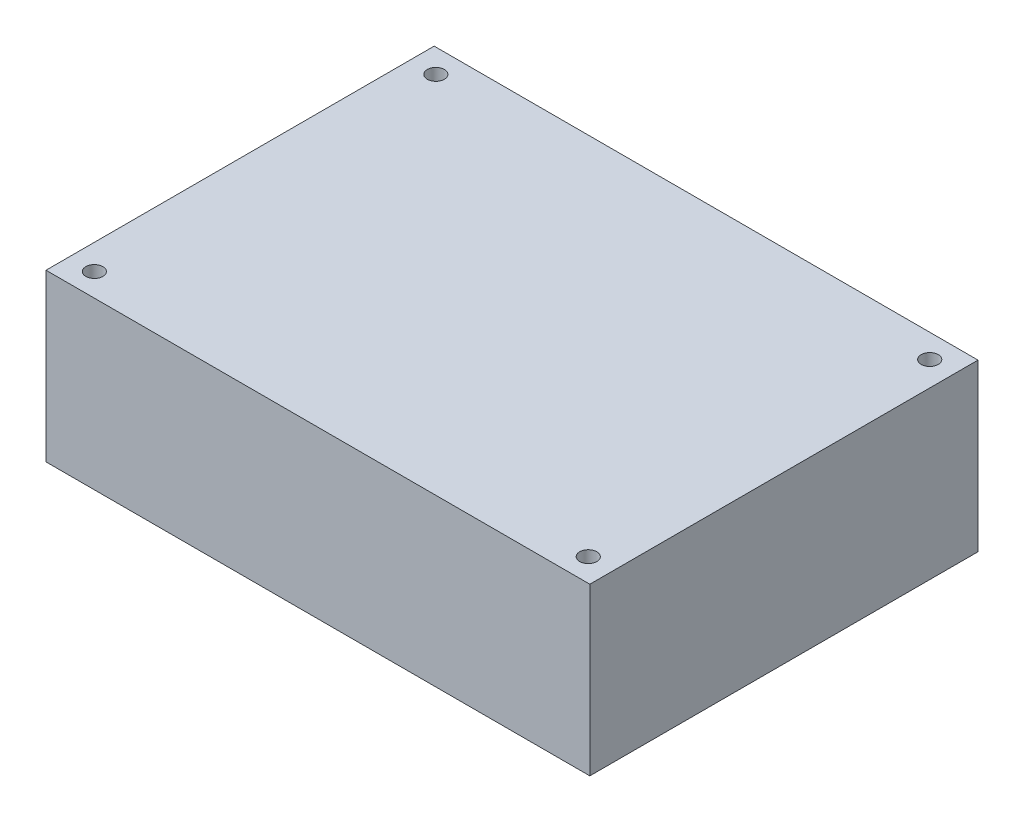
ISO-10303-21;
HEADER;
FILE_DESCRIPTION(('STEP AP214'),'2;1');
FILE_NAME('part.step','',(''),(''),'','','');
FILE_SCHEMA(('AUTOMOTIVE_DESIGN { 1 0 10303 214 1 1 1 1 }'));
ENDSEC;
DATA;
#1=APPLICATION_CONTEXT('core data for automotive mechanical design processes');
#2=APPLICATION_PROTOCOL_DEFINITION('international standard','automotive_design',2000,#1);
#3=PRODUCT_CONTEXT('',#1,'mechanical');
#4=PRODUCT('Part','Part','',(#3));
#5=PRODUCT_RELATED_PRODUCT_CATEGORY('part','',(#4));
#6=PRODUCT_DEFINITION_FORMATION('','',#4);
#7=PRODUCT_DEFINITION_CONTEXT('part definition',#1,'design');
#8=PRODUCT_DEFINITION('design','',#6,#7);
#9=PRODUCT_DEFINITION_SHAPE('','',#8);
#10=(LENGTH_UNIT() NAMED_UNIT(*) SI_UNIT(.MILLI.,.METRE.));
#11=(NAMED_UNIT(*) PLANE_ANGLE_UNIT() SI_UNIT($,.RADIAN.));
#12=(NAMED_UNIT(*) SI_UNIT($,.STERADIAN.) SOLID_ANGLE_UNIT());
#13=UNCERTAINTY_MEASURE_WITH_UNIT(LENGTH_MEASURE(1.E-05),#10,'distance_accuracy_value','');
#14=(GEOMETRIC_REPRESENTATION_CONTEXT(3) GLOBAL_UNCERTAINTY_ASSIGNED_CONTEXT((#13)) GLOBAL_UNIT_ASSIGNED_CONTEXT((#10,
#11,#12)) REPRESENTATION_CONTEXT('',''));
#15=CARTESIAN_POINT('',(0.,0.,0.));
#16=DIRECTION('',(0.,0.,1.));
#17=DIRECTION('',(1.,0.,0.));
#18=AXIS2_PLACEMENT_3D('',#15,#16,#17);
#19=CARTESIAN_POINT('',(-35.052,21.3995,-25.019));
#20=DIRECTION('',(1.,0.,0.));
#21=DIRECTION('',(0.,0.,-1.));
#22=AXIS2_PLACEMENT_3D('',#19,#20,#21);
#23=PLANE('',#22);
#24=DIRECTION('',(0.,0.,1.));
#25=VECTOR('',#24,1.);
#26=CARTESIAN_POINT('',(-35.052,0.,-25.019));
#27=LINE('',#26,#25);
#28=CARTESIAN_POINT('',(-35.052,0.,-25.019));
#29=VERTEX_POINT('',#28);
#30=CARTESIAN_POINT('',(-35.052,0.,25.019));
#31=VERTEX_POINT('',#30);
#32=EDGE_CURVE('E123',#29,#31,#27,.T.);
#33=ORIENTED_EDGE('',*,*,#32,.T.);
#34=DIRECTION('',(0.,-1.,0.));
#35=VECTOR('',#34,1.);
#36=CARTESIAN_POINT('',(-35.052,21.3995,25.019));
#37=LINE('',#36,#35);
#38=CARTESIAN_POINT('',(-35.052,21.3995,25.019));
#39=VERTEX_POINT('',#38);
#40=EDGE_CURVE('E13',#39,#31,#37,.T.);
#41=ORIENTED_EDGE('',*,*,#40,.F.);
#42=DIRECTION('',(0.,0.,1.));
#43=VECTOR('',#42,1.);
#44=CARTESIAN_POINT('',(-35.052,21.3995,-25.019));
#45=LINE('',#44,#43);
#46=CARTESIAN_POINT('',(-35.052,21.3995,-25.019));
#47=VERTEX_POINT('',#46);
#48=EDGE_CURVE('E107',#47,#39,#45,.T.);
#49=ORIENTED_EDGE('',*,*,#48,.F.);
#50=DIRECTION('',(0.,-1.,0.));
#51=VECTOR('',#50,1.);
#52=CARTESIAN_POINT('',(-35.052,21.3995,-25.019));
#53=LINE('',#52,#51);
#54=EDGE_CURVE('E119',#47,#29,#53,.T.);
#55=ORIENTED_EDGE('',*,*,#54,.T.);
#56=EDGE_LOOP('',(#33,#41,#49,#55));
#57=FACE_BOUND('',#56,.T.);
#58=ADVANCED_FACE('F55',(#57),#23,.F.);
#59=CARTESIAN_POINT('',(-35.052,21.3995,25.019));
#60=DIRECTION('',(0.,0.,-1.));
#61=DIRECTION('',(-1.,0.,0.));
#62=AXIS2_PLACEMENT_3D('',#59,#60,#61);
#63=PLANE('',#62);
#64=DIRECTION('',(1.,0.,0.));
#65=VECTOR('',#64,1.);
#66=CARTESIAN_POINT('',(-35.052,0.,25.019));
#67=LINE('',#66,#65);
#68=CARTESIAN_POINT('',(35.052,0.,25.019));
#69=VERTEX_POINT('',#68);
#70=EDGE_CURVE('E112',#31,#69,#67,.T.);
#71=ORIENTED_EDGE('',*,*,#70,.T.);
#72=DIRECTION('',(0.,-1.,0.));
#73=VECTOR('',#72,1.);
#74=CARTESIAN_POINT('',(35.052,21.3995,25.019));
#75=LINE('',#74,#73);
#76=CARTESIAN_POINT('',(35.052,21.3995,25.019));
#77=VERTEX_POINT('',#76);
#78=EDGE_CURVE('E63',#77,#69,#75,.T.);
#79=ORIENTED_EDGE('',*,*,#78,.F.);
#80=DIRECTION('',(1.,0.,0.));
#81=VECTOR('',#80,1.);
#82=CARTESIAN_POINT('',(-35.052,21.3995,25.019));
#83=LINE('',#82,#81);
#84=EDGE_CURVE('E102',#39,#77,#83,.T.);
#85=ORIENTED_EDGE('',*,*,#84,.F.);
#86=ORIENTED_EDGE('',*,*,#40,.T.);
#87=EDGE_LOOP('',(#71,#79,#85,#86));
#88=FACE_BOUND('',#87,.T.);
#89=ADVANCED_FACE('F111',(#88),#63,.F.);
#90=CARTESIAN_POINT('',(35.052,21.3995,-25.019));
#91=DIRECTION('',(-1.,0.,0.));
#92=DIRECTION('',(0.,0.,1.));
#93=AXIS2_PLACEMENT_3D('',#90,#91,#92);
#94=PLANE('',#93);
#95=DIRECTION('',(0.,0.,-1.));
#96=VECTOR('',#95,1.);
#97=CARTESIAN_POINT('',(35.052,0.,-25.019));
#98=LINE('',#97,#96);
#99=CARTESIAN_POINT('',(35.052,0.,-25.019));
#100=VERTEX_POINT('',#99);
#101=EDGE_CURVE('E89',#69,#100,#98,.T.);
#102=ORIENTED_EDGE('',*,*,#101,.T.);
#103=DIRECTION('',(0.,-1.,0.));
#104=VECTOR('',#103,1.);
#105=CARTESIAN_POINT('',(35.052,21.3995,-25.019));
#106=LINE('',#105,#104);
#107=CARTESIAN_POINT('',(35.052,21.3995,-25.019));
#108=VERTEX_POINT('',#107);
#109=EDGE_CURVE('E113',#108,#100,#106,.T.);
#110=ORIENTED_EDGE('',*,*,#109,.F.);
#111=DIRECTION('',(0.,0.,-1.));
#112=VECTOR('',#111,1.);
#113=CARTESIAN_POINT('',(35.052,21.3995,-25.019));
#114=LINE('',#113,#112);
#115=EDGE_CURVE('E105',#77,#108,#114,.T.);
#116=ORIENTED_EDGE('',*,*,#115,.F.);
#117=ORIENTED_EDGE('',*,*,#78,.T.);
#118=EDGE_LOOP('',(#102,#110,#116,#117));
#119=FACE_BOUND('',#118,.T.);
#120=ADVANCED_FACE('F114',(#119),#94,.F.);
#121=CARTESIAN_POINT('',(-35.052,21.3995,-25.019));
#122=DIRECTION('',(0.,0.,1.));
#123=DIRECTION('',(1.,0.,0.));
#124=AXIS2_PLACEMENT_3D('',#121,#122,#123);
#125=PLANE('',#124);
#126=DIRECTION('',(-1.,0.,0.));
#127=VECTOR('',#126,1.);
#128=CARTESIAN_POINT('',(-35.052,0.,-25.019));
#129=LINE('',#128,#127);
#130=EDGE_CURVE('E95',#100,#29,#129,.T.);
#131=ORIENTED_EDGE('',*,*,#130,.T.);
#132=ORIENTED_EDGE('',*,*,#54,.F.);
#133=DIRECTION('',(-1.,0.,0.));
#134=VECTOR('',#133,1.);
#135=CARTESIAN_POINT('',(-35.052,21.3995,-25.019));
#136=LINE('',#135,#134);
#137=EDGE_CURVE('E71',#108,#47,#136,.T.);
#138=ORIENTED_EDGE('',*,*,#137,.F.);
#139=ORIENTED_EDGE('',*,*,#109,.T.);
#140=EDGE_LOOP('',(#131,#132,#138,#139));
#141=FACE_BOUND('',#140,.T.);
#142=ADVANCED_FACE('F133',(#141),#125,.F.);
#143=CARTESIAN_POINT('',(0.,21.3995,0.));
#144=DIRECTION('',(0.,1.,0.));
#145=DIRECTION('',(0.,0.,1.));
#146=AXIS2_PLACEMENT_3D('',#143,#144,#145);
#147=PLANE('',#146);
#148=CARTESIAN_POINT('',(31.877,21.3995,-21.971));
#149=DIRECTION('',(0.,-1.,0.));
#150=DIRECTION('',(0.,0.,-1.));
#151=AXIS2_PLACEMENT_3D('',#148,#149,#150);
#152=CIRCLE('',#151,1.1);
#153=CARTESIAN_POINT('',(31.877,21.3995,-23.071));
#154=VERTEX_POINT('',#153);
#155=EDGE_CURVE('E156',#154,#154,#152,.T.);
#156=ORIENTED_EDGE('',*,*,#155,.T.);
#157=EDGE_LOOP('',(#156));
#158=FACE_BOUND('',#157,.T.);
#159=CARTESIAN_POINT('',(31.877,21.3995,22.0472));
#160=DIRECTION('',(0.,-1.,0.));
#161=DIRECTION('',(0.,0.,-1.));
#162=AXIS2_PLACEMENT_3D('',#159,#160,#161);
#163=CIRCLE('',#162,1.1);
#164=CARTESIAN_POINT('',(31.877,21.3995,20.9472));
#165=VERTEX_POINT('',#164);
#166=EDGE_CURVE('E150',#165,#165,#163,.T.);
#167=ORIENTED_EDGE('',*,*,#166,.T.);
#168=EDGE_LOOP('',(#167));
#169=FACE_BOUND('',#168,.T.);
#170=CARTESIAN_POINT('',(-31.7881,21.3995,22.0472));
#171=DIRECTION('',(0.,-1.,0.));
#172=DIRECTION('',(0.,0.,-1.));
#173=AXIS2_PLACEMENT_3D('',#170,#171,#172);
#174=CIRCLE('',#173,1.1);
#175=CARTESIAN_POINT('',(-31.7881,21.3995,20.9472));
#176=VERTEX_POINT('',#175);
#177=EDGE_CURVE('E144',#176,#176,#174,.T.);
#178=ORIENTED_EDGE('',*,*,#177,.T.);
#179=EDGE_LOOP('',(#178));
#180=FACE_BOUND('',#179,.T.);
#181=CARTESIAN_POINT('',(-31.7881,21.3995,-21.971));
#182=DIRECTION('',(0.,-1.,0.));
#183=DIRECTION('',(0.,0.,-1.));
#184=AXIS2_PLACEMENT_3D('',#181,#182,#183);
#185=CIRCLE('',#184,1.1);
#186=CARTESIAN_POINT('',(-31.7881,21.3995,-23.071));
#187=VERTEX_POINT('',#186);
#188=EDGE_CURVE('E126',#187,#187,#185,.T.);
#189=ORIENTED_EDGE('',*,*,#188,.T.);
#190=EDGE_LOOP('',(#189));
#191=FACE_BOUND('',#190,.T.);
#192=ORIENTED_EDGE('',*,*,#48,.T.);
#193=ORIENTED_EDGE('',*,*,#84,.T.);
#194=ORIENTED_EDGE('',*,*,#115,.T.);
#195=ORIENTED_EDGE('',*,*,#137,.T.);
#196=EDGE_LOOP('',(#192,#193,#194,#195));
#197=FACE_BOUND('',#196,.T.);
#198=ADVANCED_FACE('F103',(#158,#169,#180,#191,#197),#147,.T.);
#199=CARTESIAN_POINT('',(0.,0.,0.));
#200=DIRECTION('',(0.,1.,0.));
#201=DIRECTION('',(0.,0.,1.));
#202=AXIS2_PLACEMENT_3D('',#199,#200,#201);
#203=PLANE('',#202);
#204=CARTESIAN_POINT('',(31.877,0.,-21.971));
#205=DIRECTION('',(0.,-1.,0.));
#206=DIRECTION('',(0.,0.,-1.));
#207=AXIS2_PLACEMENT_3D('',#204,#205,#206);
#208=CIRCLE('',#207,1.1);
#209=CARTESIAN_POINT('',(31.877,0.,-23.071));
#210=VERTEX_POINT('',#209);
#211=EDGE_CURVE('E159',#210,#210,#208,.T.);
#212=ORIENTED_EDGE('',*,*,#211,.F.);
#213=EDGE_LOOP('',(#212));
#214=FACE_BOUND('',#213,.T.);
#215=CARTESIAN_POINT('',(31.877,0.,22.0472));
#216=DIRECTION('',(0.,-1.,0.));
#217=DIRECTION('',(0.,0.,-1.));
#218=AXIS2_PLACEMENT_3D('',#215,#216,#217);
#219=CIRCLE('',#218,1.1);
#220=CARTESIAN_POINT('',(31.877,0.,20.9472));
#221=VERTEX_POINT('',#220);
#222=EDGE_CURVE('E153',#221,#221,#219,.T.);
#223=ORIENTED_EDGE('',*,*,#222,.F.);
#224=EDGE_LOOP('',(#223));
#225=FACE_BOUND('',#224,.T.);
#226=CARTESIAN_POINT('',(-31.7881,0.,22.0472));
#227=DIRECTION('',(0.,-1.,0.));
#228=DIRECTION('',(0.,0.,-1.));
#229=AXIS2_PLACEMENT_3D('',#226,#227,#228);
#230=CIRCLE('',#229,1.1);
#231=CARTESIAN_POINT('',(-31.7881,0.,20.9472));
#232=VERTEX_POINT('',#231);
#233=EDGE_CURVE('E147',#232,#232,#230,.T.);
#234=ORIENTED_EDGE('',*,*,#233,.F.);
#235=EDGE_LOOP('',(#234));
#236=FACE_BOUND('',#235,.T.);
#237=CARTESIAN_POINT('',(-31.7881,0.,-21.971));
#238=DIRECTION('',(0.,-1.,0.));
#239=DIRECTION('',(0.,0.,-1.));
#240=AXIS2_PLACEMENT_3D('',#237,#238,#239);
#241=CIRCLE('',#240,1.1);
#242=CARTESIAN_POINT('',(-31.7881,0.,-23.071));
#243=VERTEX_POINT('',#242);
#244=EDGE_CURVE('E141',#243,#243,#241,.T.);
#245=ORIENTED_EDGE('',*,*,#244,.F.);
#246=EDGE_LOOP('',(#245));
#247=FACE_BOUND('',#246,.T.);
#248=ORIENTED_EDGE('',*,*,#32,.F.);
#249=ORIENTED_EDGE('',*,*,#130,.F.);
#250=ORIENTED_EDGE('',*,*,#101,.F.);
#251=ORIENTED_EDGE('',*,*,#70,.F.);
#252=EDGE_LOOP('',(#248,#249,#250,#251));
#253=FACE_BOUND('',#252,.T.);
#254=ADVANCED_FACE('F136',(#214,#225,#236,#247,#253),#203,.F.);
#255=CARTESIAN_POINT('',(-31.7881,0.,-21.971));
#256=DIRECTION('',(0.,-1.,0.));
#257=DIRECTION('',(0.,0.,-1.));
#258=AXIS2_PLACEMENT_3D('',#255,#256,#257);
#259=CYLINDRICAL_SURFACE('',#258,1.1);
#260=ORIENTED_EDGE('',*,*,#188,.F.);
#261=EDGE_LOOP('',(#260));
#262=FACE_BOUND('',#261,.T.);
#263=ORIENTED_EDGE('',*,*,#244,.T.);
#264=EDGE_LOOP('',(#263));
#265=FACE_BOUND('',#264,.T.);
#266=ADVANCED_FACE('F167',(#262,#265),#259,.F.);
#267=CARTESIAN_POINT('',(-31.7881,0.,22.0472));
#268=DIRECTION('',(0.,-1.,0.));
#269=DIRECTION('',(0.,0.,-1.));
#270=AXIS2_PLACEMENT_3D('',#267,#268,#269);
#271=CYLINDRICAL_SURFACE('',#270,1.1);
#272=ORIENTED_EDGE('',*,*,#177,.F.);
#273=EDGE_LOOP('',(#272));
#274=FACE_BOUND('',#273,.T.);
#275=ORIENTED_EDGE('',*,*,#233,.T.);
#276=EDGE_LOOP('',(#275));
#277=FACE_BOUND('',#276,.T.);
#278=ADVANCED_FACE('F176',(#274,#277),#271,.F.);
#279=CARTESIAN_POINT('',(31.877,0.,22.0472));
#280=DIRECTION('',(0.,-1.,0.));
#281=DIRECTION('',(0.,0.,-1.));
#282=AXIS2_PLACEMENT_3D('',#279,#280,#281);
#283=CYLINDRICAL_SURFACE('',#282,1.1);
#284=ORIENTED_EDGE('',*,*,#166,.F.);
#285=EDGE_LOOP('',(#284));
#286=FACE_BOUND('',#285,.T.);
#287=ORIENTED_EDGE('',*,*,#222,.T.);
#288=EDGE_LOOP('',(#287));
#289=FACE_BOUND('',#288,.T.);
#290=ADVANCED_FACE('F182',(#286,#289),#283,.F.);
#291=CARTESIAN_POINT('',(31.877,0.,-21.971));
#292=DIRECTION('',(0.,-1.,0.));
#293=DIRECTION('',(0.,0.,-1.));
#294=AXIS2_PLACEMENT_3D('',#291,#292,#293);
#295=CYLINDRICAL_SURFACE('',#294,1.1);
#296=ORIENTED_EDGE('',*,*,#155,.F.);
#297=EDGE_LOOP('',(#296));
#298=FACE_BOUND('',#297,.T.);
#299=ORIENTED_EDGE('',*,*,#211,.T.);
#300=EDGE_LOOP('',(#299));
#301=FACE_BOUND('',#300,.T.);
#302=ADVANCED_FACE('F163',(#298,#301),#295,.F.);
#303=CLOSED_SHELL('',(#58,#89,#120,#142,#198,#254,#266,#278,#290,#302));
#304=MANIFOLD_SOLID_BREP('B2',#303);
#305=ADVANCED_BREP_SHAPE_REPRESENTATION('',(#18,#304),#14);
#306=SHAPE_DEFINITION_REPRESENTATION(#9,#305);
ENDSEC;
END-ISO-10303-21;
